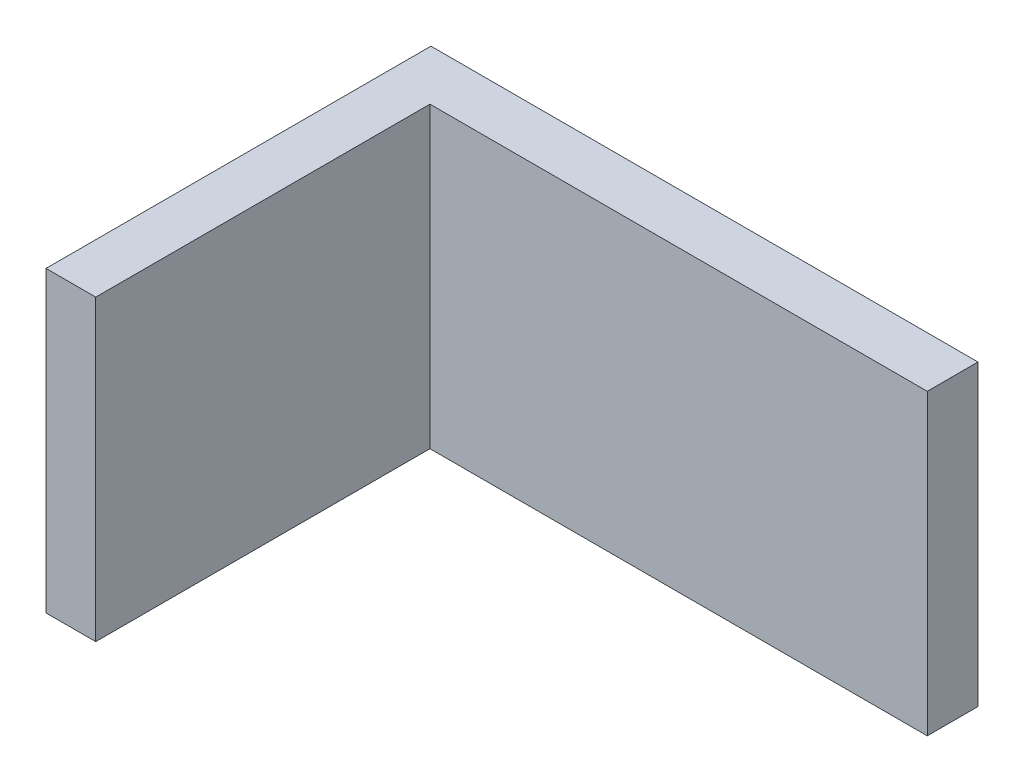
ISO-10303-21;
HEADER;
FILE_DESCRIPTION(('STEP AP214'),'2;1');
FILE_NAME('part.step','',(''),(''),'','','');
FILE_SCHEMA(('AUTOMOTIVE_DESIGN { 1 0 10303 214 1 1 1 1 }'));
ENDSEC;
DATA;
#1=APPLICATION_CONTEXT('core data for automotive mechanical design processes');
#2=APPLICATION_PROTOCOL_DEFINITION('international standard','automotive_design',2000,#1);
#3=PRODUCT_CONTEXT('',#1,'mechanical');
#4=PRODUCT('Part','Part','',(#3));
#5=PRODUCT_RELATED_PRODUCT_CATEGORY('part','',(#4));
#6=PRODUCT_DEFINITION_FORMATION('','',#4);
#7=PRODUCT_DEFINITION_CONTEXT('part definition',#1,'design');
#8=PRODUCT_DEFINITION('design','',#6,#7);
#9=PRODUCT_DEFINITION_SHAPE('','',#8);
#10=(LENGTH_UNIT() NAMED_UNIT(*) SI_UNIT(.MILLI.,.METRE.));
#11=(NAMED_UNIT(*) PLANE_ANGLE_UNIT() SI_UNIT($,.RADIAN.));
#12=(NAMED_UNIT(*) SI_UNIT($,.STERADIAN.) SOLID_ANGLE_UNIT());
#13=UNCERTAINTY_MEASURE_WITH_UNIT(LENGTH_MEASURE(1.E-05),#10,'distance_accuracy_value','');
#14=(GEOMETRIC_REPRESENTATION_CONTEXT(3) GLOBAL_UNCERTAINTY_ASSIGNED_CONTEXT((#13)) GLOBAL_UNIT_ASSIGNED_CONTEXT((#10,
#11,#12)) REPRESENTATION_CONTEXT('',''));
#15=CARTESIAN_POINT('',(0.,0.,0.));
#16=DIRECTION('',(0.,0.,1.));
#17=DIRECTION('',(1.,0.,0.));
#18=AXIS2_PLACEMENT_3D('',#15,#16,#17);
#19=CARTESIAN_POINT('',(-4.55,1.1,0.));
#20=DIRECTION('',(0.,-1.,0.));
#21=DIRECTION('',(0.,0.,1.));
#22=AXIS2_PLACEMENT_3D('',#19,#20,#21);
#23=PLANE('',#22);
#24=DIRECTION('',(-1.,0.,0.));
#25=VECTOR('',#24,1.);
#26=CARTESIAN_POINT('',(-4.,1.1,0.));
#27=LINE('',#26,#25);
#28=CARTESIAN_POINT('',(-4.,1.1,0.));
#29=VERTEX_POINT('',#28);
#30=CARTESIAN_POINT('',(-4.55,1.1,0.));
#31=VERTEX_POINT('',#30);
#32=EDGE_CURVE('E11',#29,#31,#27,.T.);
#33=ORIENTED_EDGE('',*,*,#32,.F.);
#34=DIRECTION('',(0.,0.,-1.));
#35=VECTOR('',#34,1.);
#36=CARTESIAN_POINT('',(-4.,1.1,0.051));
#37=LINE('',#36,#35);
#38=CARTESIAN_POINT('',(-4.,1.1,0.051));
#39=VERTEX_POINT('',#38);
#40=EDGE_CURVE('E24',#39,#29,#37,.T.);
#41=ORIENTED_EDGE('',*,*,#40,.F.);
#42=DIRECTION('',(1.,0.,0.));
#43=VECTOR('',#42,1.);
#44=CARTESIAN_POINT('',(-4.5,1.1,0.051));
#45=LINE('',#44,#43);
#46=CARTESIAN_POINT('',(-4.5,1.1,0.051));
#47=VERTEX_POINT('',#46);
#48=EDGE_CURVE('E87',#47,#39,#45,.T.);
#49=ORIENTED_EDGE('',*,*,#48,.F.);
#50=DIRECTION('',(0.,0.,-1.));
#51=VECTOR('',#50,1.);
#52=CARTESIAN_POINT('',(-4.5,1.1,0.387));
#53=LINE('',#52,#51);
#54=CARTESIAN_POINT('',(-4.5,1.1,0.387));
#55=VERTEX_POINT('',#54);
#56=EDGE_CURVE('E114',#55,#47,#53,.T.);
#57=ORIENTED_EDGE('',*,*,#56,.F.);
#58=DIRECTION('',(1.,0.,0.));
#59=VECTOR('',#58,1.);
#60=CARTESIAN_POINT('',(-4.55,1.1,0.387));
#61=LINE('',#60,#59);
#62=CARTESIAN_POINT('',(-4.55,1.1,0.387));
#63=VERTEX_POINT('',#62);
#64=EDGE_CURVE('E111',#63,#55,#61,.T.);
#65=ORIENTED_EDGE('',*,*,#64,.F.);
#66=DIRECTION('',(0.,0.,1.));
#67=VECTOR('',#66,1.);
#68=CARTESIAN_POINT('',(-4.55,1.1,0.));
#69=LINE('',#68,#67);
#70=EDGE_CURVE('E108',#31,#63,#69,.T.);
#71=ORIENTED_EDGE('',*,*,#70,.F.);
#72=EDGE_LOOP('',(#33,#41,#49,#57,#65,#71));
#73=FACE_BOUND('',#72,.T.);
#74=ADVANCED_FACE('F17',(#73),#23,.T.);
#75=CARTESIAN_POINT('',(-4.,1.4,0.));
#76=DIRECTION('',(0.,1.,0.));
#77=DIRECTION('',(0.,0.,1.));
#78=AXIS2_PLACEMENT_3D('',#75,#76,#77);
#79=PLANE('',#78);
#80=DIRECTION('',(1.,0.,0.));
#81=VECTOR('',#80,1.);
#82=CARTESIAN_POINT('',(-4.55,1.4,0.));
#83=LINE('',#82,#81);
#84=CARTESIAN_POINT('',(-4.55,1.4,0.));
#85=VERTEX_POINT('',#84);
#86=CARTESIAN_POINT('',(-4.,1.4,0.));
#87=VERTEX_POINT('',#86);
#88=EDGE_CURVE('E106',#85,#87,#83,.T.);
#89=ORIENTED_EDGE('',*,*,#88,.F.);
#90=DIRECTION('',(0.,0.,-1.));
#91=VECTOR('',#90,1.);
#92=CARTESIAN_POINT('',(-4.55,1.4,0.387));
#93=LINE('',#92,#91);
#94=CARTESIAN_POINT('',(-4.55,1.4,0.387));
#95=VERTEX_POINT('',#94);
#96=EDGE_CURVE('E103',#95,#85,#93,.T.);
#97=ORIENTED_EDGE('',*,*,#96,.F.);
#98=DIRECTION('',(-1.,0.,0.));
#99=VECTOR('',#98,1.);
#100=CARTESIAN_POINT('',(-4.5,1.4,0.387));
#101=LINE('',#100,#99);
#102=CARTESIAN_POINT('',(-4.5,1.4,0.387));
#103=VERTEX_POINT('',#102);
#104=EDGE_CURVE('E100',#103,#95,#101,.T.);
#105=ORIENTED_EDGE('',*,*,#104,.F.);
#106=DIRECTION('',(0.,0.,1.));
#107=VECTOR('',#106,1.);
#108=CARTESIAN_POINT('',(-4.5,1.4,0.051));
#109=LINE('',#108,#107);
#110=CARTESIAN_POINT('',(-4.5,1.4,0.051));
#111=VERTEX_POINT('',#110);
#112=EDGE_CURVE('E72',#111,#103,#109,.T.);
#113=ORIENTED_EDGE('',*,*,#112,.F.);
#114=DIRECTION('',(-1.,0.,0.));
#115=VECTOR('',#114,1.);
#116=CARTESIAN_POINT('',(-4.,1.4,0.051));
#117=LINE('',#116,#115);
#118=CARTESIAN_POINT('',(-4.,1.4,0.051));
#119=VERTEX_POINT('',#118);
#120=EDGE_CURVE('E66',#119,#111,#117,.T.);
#121=ORIENTED_EDGE('',*,*,#120,.F.);
#122=DIRECTION('',(0.,0.,1.));
#123=VECTOR('',#122,1.);
#124=CARTESIAN_POINT('',(-4.,1.4,0.));
#125=LINE('',#124,#123);
#126=EDGE_CURVE('E69',#87,#119,#125,.T.);
#127=ORIENTED_EDGE('',*,*,#126,.F.);
#128=EDGE_LOOP('',(#89,#97,#105,#113,#121,#127));
#129=FACE_BOUND('',#128,.T.);
#130=ADVANCED_FACE('F68',(#129),#79,.T.);
#131=CARTESIAN_POINT('',(-4.55,1.1,0.387));
#132=DIRECTION('',(0.,0.,1.));
#133=DIRECTION('',(0.,1.,0.));
#134=AXIS2_PLACEMENT_3D('',#131,#132,#133);
#135=PLANE('',#134);
#136=ORIENTED_EDGE('',*,*,#64,.T.);
#137=DIRECTION('',(0.,-1.,0.));
#138=VECTOR('',#137,1.);
#139=CARTESIAN_POINT('',(-4.5,1.4,0.387));
#140=LINE('',#139,#138);
#141=EDGE_CURVE('E83',#103,#55,#140,.T.);
#142=ORIENTED_EDGE('',*,*,#141,.F.);
#143=ORIENTED_EDGE('',*,*,#104,.T.);
#144=DIRECTION('',(0.,1.,0.));
#145=VECTOR('',#144,1.);
#146=CARTESIAN_POINT('',(-4.55,1.1,0.387));
#147=LINE('',#146,#145);
#148=EDGE_CURVE('E88',#63,#95,#147,.T.);
#149=ORIENTED_EDGE('',*,*,#148,.F.);
#150=EDGE_LOOP('',(#136,#142,#143,#149));
#151=FACE_BOUND('',#150,.T.);
#152=ADVANCED_FACE('F125',(#151),#135,.T.);
#153=CARTESIAN_POINT('',(-4.5,1.1,0.051));
#154=DIRECTION('',(0.,0.,1.));
#155=DIRECTION('',(0.,1.,0.));
#156=AXIS2_PLACEMENT_3D('',#153,#154,#155);
#157=PLANE('',#156);
#158=ORIENTED_EDGE('',*,*,#48,.T.);
#159=DIRECTION('',(0.,-1.,0.));
#160=VECTOR('',#159,1.);
#161=CARTESIAN_POINT('',(-4.,1.4,0.051));
#162=LINE('',#161,#160);
#163=EDGE_CURVE('E81',#119,#39,#162,.T.);
#164=ORIENTED_EDGE('',*,*,#163,.F.);
#165=ORIENTED_EDGE('',*,*,#120,.T.);
#166=DIRECTION('',(0.,1.,0.));
#167=VECTOR('',#166,1.);
#168=CARTESIAN_POINT('',(-4.5,1.1,0.051));
#169=LINE('',#168,#167);
#170=EDGE_CURVE('E89',#47,#111,#169,.T.);
#171=ORIENTED_EDGE('',*,*,#170,.F.);
#172=EDGE_LOOP('',(#158,#164,#165,#171));
#173=FACE_BOUND('',#172,.T.);
#174=ADVANCED_FACE('F86',(#173),#157,.T.);
#175=CARTESIAN_POINT('',(-4.55,1.4,0.));
#176=DIRECTION('',(-1.,0.,0.));
#177=DIRECTION('',(0.,0.,1.));
#178=AXIS2_PLACEMENT_3D('',#175,#176,#177);
#179=PLANE('',#178);
#180=DIRECTION('',(0.,1.,0.));
#181=VECTOR('',#180,1.);
#182=CARTESIAN_POINT('',(-4.55,1.1,0.));
#183=LINE('',#182,#181);
#184=EDGE_CURVE('E93',#31,#85,#183,.T.);
#185=ORIENTED_EDGE('',*,*,#184,.F.);
#186=ORIENTED_EDGE('',*,*,#70,.T.);
#187=ORIENTED_EDGE('',*,*,#148,.T.);
#188=ORIENTED_EDGE('',*,*,#96,.T.);
#189=EDGE_LOOP('',(#185,#186,#187,#188));
#190=FACE_BOUND('',#189,.T.);
#191=ADVANCED_FACE('F121',(#190),#179,.T.);
#192=CARTESIAN_POINT('',(-4.,1.1,0.));
#193=DIRECTION('',(1.,0.,0.));
#194=DIRECTION('',(0.,0.,1.));
#195=AXIS2_PLACEMENT_3D('',#192,#193,#194);
#196=PLANE('',#195);
#197=DIRECTION('',(0.,-1.,0.));
#198=VECTOR('',#197,1.);
#199=CARTESIAN_POINT('',(-4.,1.4,0.));
#200=LINE('',#199,#198);
#201=EDGE_CURVE('E82',#87,#29,#200,.T.);
#202=ORIENTED_EDGE('',*,*,#201,.F.);
#203=ORIENTED_EDGE('',*,*,#126,.T.);
#204=ORIENTED_EDGE('',*,*,#163,.T.);
#205=ORIENTED_EDGE('',*,*,#40,.T.);
#206=EDGE_LOOP('',(#202,#203,#204,#205));
#207=FACE_BOUND('',#206,.T.);
#208=ADVANCED_FACE('F80',(#207),#196,.T.);
#209=CARTESIAN_POINT('',(-4.5,1.1,0.051));
#210=DIRECTION('',(1.,0.,0.));
#211=DIRECTION('',(0.,0.,1.));
#212=AXIS2_PLACEMENT_3D('',#209,#210,#211);
#213=PLANE('',#212);
#214=ORIENTED_EDGE('',*,*,#170,.T.);
#215=ORIENTED_EDGE('',*,*,#112,.T.);
#216=ORIENTED_EDGE('',*,*,#141,.T.);
#217=ORIENTED_EDGE('',*,*,#56,.T.);
#218=EDGE_LOOP('',(#214,#215,#216,#217));
#219=FACE_BOUND('',#218,.T.);
#220=ADVANCED_FACE('F127',(#219),#213,.T.);
#221=CARTESIAN_POINT('',(-4.55,1.4,0.));
#222=DIRECTION('',(0.,0.,-1.));
#223=DIRECTION('',(0.,1.,0.));
#224=AXIS2_PLACEMENT_3D('',#221,#222,#223);
#225=PLANE('',#224);
#226=ORIENTED_EDGE('',*,*,#88,.T.);
#227=ORIENTED_EDGE('',*,*,#201,.T.);
#228=ORIENTED_EDGE('',*,*,#32,.T.);
#229=ORIENTED_EDGE('',*,*,#184,.T.);
#230=EDGE_LOOP('',(#226,#227,#228,#229));
#231=FACE_BOUND('',#230,.T.);
#232=ADVANCED_FACE('F117',(#231),#225,.T.);
#233=CLOSED_SHELL('',(#74,#130,#152,#174,#191,#208,#220,#232));
#234=MANIFOLD_SOLID_BREP('B1',#233);
#235=ADVANCED_BREP_SHAPE_REPRESENTATION('',(#18,#234),#14);
#236=SHAPE_DEFINITION_REPRESENTATION(#9,#235);
ENDSEC;
END-ISO-10303-21;
